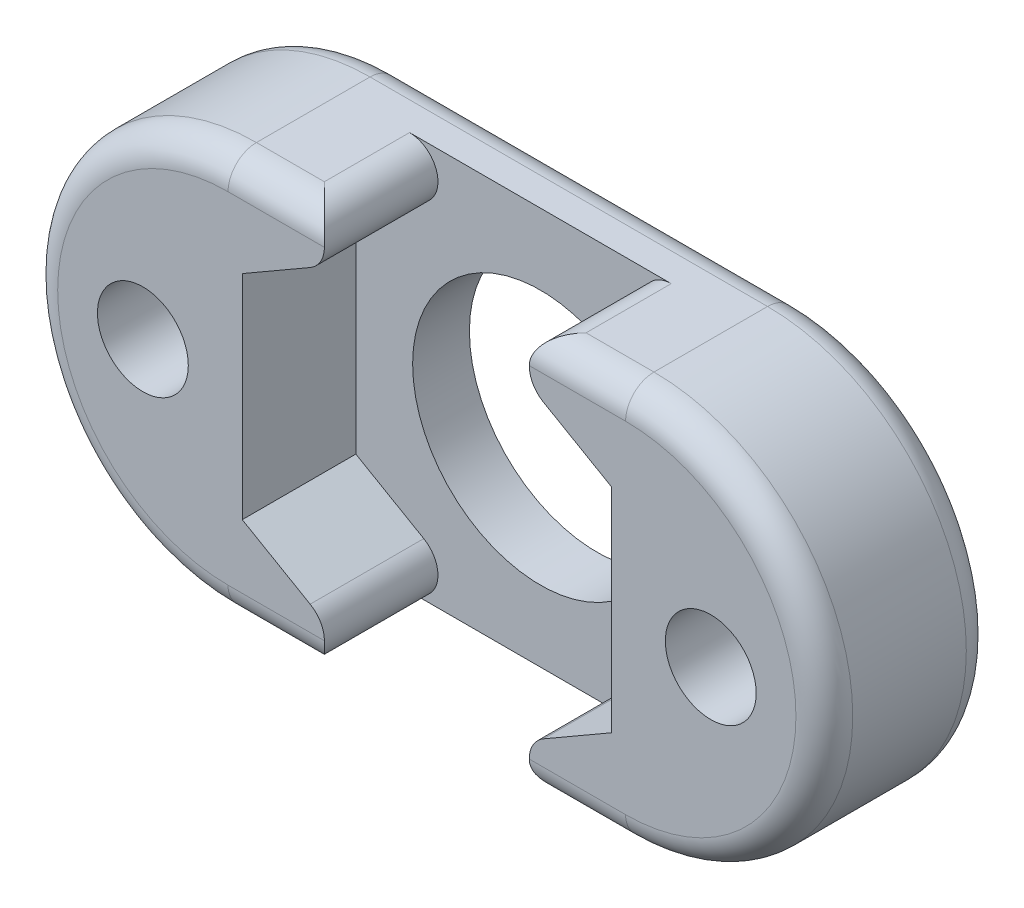
ISO-10303-21;
HEADER;
FILE_DESCRIPTION(('STEP AP214'),'2;1');
FILE_NAME('part.step','',(''),(''),'','','');
FILE_SCHEMA(('AUTOMOTIVE_DESIGN { 1 0 10303 214 1 1 1 1 }'));
ENDSEC;
DATA;
#1=APPLICATION_CONTEXT('core data for automotive mechanical design processes');
#2=APPLICATION_PROTOCOL_DEFINITION('international standard','automotive_design',2000,#1);
#3=PRODUCT_CONTEXT('',#1,'mechanical');
#4=PRODUCT('Part','Part','',(#3));
#5=PRODUCT_RELATED_PRODUCT_CATEGORY('part','',(#4));
#6=PRODUCT_DEFINITION_FORMATION('','',#4);
#7=PRODUCT_DEFINITION_CONTEXT('part definition',#1,'design');
#8=PRODUCT_DEFINITION('design','',#6,#7);
#9=PRODUCT_DEFINITION_SHAPE('','',#8);
#10=(LENGTH_UNIT() NAMED_UNIT(*) SI_UNIT(.MILLI.,.METRE.));
#11=(NAMED_UNIT(*) PLANE_ANGLE_UNIT() SI_UNIT($,.RADIAN.));
#12=(NAMED_UNIT(*) SI_UNIT($,.STERADIAN.) SOLID_ANGLE_UNIT());
#13=UNCERTAINTY_MEASURE_WITH_UNIT(LENGTH_MEASURE(1.E-05),#10,'distance_accuracy_value','');
#14=(GEOMETRIC_REPRESENTATION_CONTEXT(3) GLOBAL_UNCERTAINTY_ASSIGNED_CONTEXT((#13)) GLOBAL_UNIT_ASSIGNED_CONTEXT((#10,
#11,#12)) REPRESENTATION_CONTEXT('',''));
#15=CARTESIAN_POINT('',(0.,0.,0.));
#16=DIRECTION('',(0.,0.,1.));
#17=DIRECTION('',(1.,0.,0.));
#18=AXIS2_PLACEMENT_3D('',#15,#16,#17);
#19=CARTESIAN_POINT('',(-27.2541785109983,0.,6.));
#20=DIRECTION('',(0.,0.,1.));
#21=DIRECTION('',(1.,0.,0.));
#22=AXIS2_PLACEMENT_3D('',#19,#20,#21);
#23=PLANE('',#22);
#24=DIRECTION('',(-0.866025403784439,-0.5,0.));
#25=VECTOR('',#24,1.);
#26=CARTESIAN_POINT('',(-20.2541785109983,7.50555349946514,6.));
#27=LINE('',#26,#25);
#28=CARTESIAN_POINT('',(-24.3618736655851,5.13397459621556,6.));
#29=VERTEX_POINT('',#28);
#30=CARTESIAN_POINT('',(-26.7541785109983,3.75277674973257,6.));
#31=VERTEX_POINT('',#30);
#32=EDGE_CURVE('E223',#29,#31,#27,.T.);
#33=ORIENTED_EDGE('',*,*,#32,.F.);
#34=CARTESIAN_POINT('',(-24.8618736655851,6.,6.));
#35=DIRECTION('',(0.,0.,1.));
#36=DIRECTION('',(1.,0.,0.));
#37=AXIS2_PLACEMENT_3D('',#34,#35,#36);
#38=CIRCLE('',#37,1.);
#39=CARTESIAN_POINT('',(-23.8618736655851,6.,6.));
#40=VERTEX_POINT('',#39);
#41=EDGE_CURVE('E305',#29,#40,#38,.T.);
#42=ORIENTED_EDGE('',*,*,#41,.T.);
#43=DIRECTION('',(-1.,0.,0.));
#44=VECTOR('',#43,1.);
#45=CARTESIAN_POINT('',(-27.2541785109983,6.,6.));
#46=LINE('',#45,#44);
#47=CARTESIAN_POINT('',(-27.2541785109983,6.,6.));
#48=VERTEX_POINT('',#47);
#49=EDGE_CURVE('E300',#40,#48,#46,.T.);
#50=ORIENTED_EDGE('',*,*,#49,.T.);
#51=CARTESIAN_POINT('',(-27.2541785109983,0.,6.));
#52=DIRECTION('',(0.,0.,1.));
#53=DIRECTION('',(1.,0.,0.));
#54=AXIS2_PLACEMENT_3D('',#51,#52,#53);
#55=CIRCLE('',#54,6.);
#56=CARTESIAN_POINT('',(-27.2541785109983,-6.,6.));
#57=VERTEX_POINT('',#56);
#58=EDGE_CURVE('E296',#48,#57,#55,.T.);
#59=ORIENTED_EDGE('',*,*,#58,.T.);
#60=DIRECTION('',(1.,0.,0.));
#61=VECTOR('',#60,1.);
#62=CARTESIAN_POINT('',(-21.1298228580162,-6.,6.));
#63=LINE('',#62,#61);
#64=CARTESIAN_POINT('',(-23.861873665585,-6.,6.));
#65=VERTEX_POINT('',#64);
#66=EDGE_CURVE('E298',#57,#65,#63,.T.);
#67=ORIENTED_EDGE('',*,*,#66,.T.);
#68=CARTESIAN_POINT('',(-24.861873665585,-6.,6.));
#69=DIRECTION('',(0.,0.,1.));
#70=DIRECTION('',(1.,0.,0.));
#71=AXIS2_PLACEMENT_3D('',#68,#69,#70);
#72=CIRCLE('',#71,1.);
#73=CARTESIAN_POINT('',(-24.361873665585,-5.13397459621556,6.));
#74=VERTEX_POINT('',#73);
#75=EDGE_CURVE('E303',#65,#74,#72,.T.);
#76=ORIENTED_EDGE('',*,*,#75,.T.);
#77=DIRECTION('',(0.866025403784439,-0.5,0.));
#78=VECTOR('',#77,1.);
#79=CARTESIAN_POINT('',(-26.7541785109983,-3.75277674973256,6.));
#80=LINE('',#79,#78);
#81=CARTESIAN_POINT('',(-26.7541785109983,-3.75277674973256,6.));
#82=VERTEX_POINT('',#81);
#83=EDGE_CURVE('E191',#82,#74,#80,.T.);
#84=ORIENTED_EDGE('',*,*,#83,.F.);
#85=DIRECTION('',(0.,-1.,0.));
#86=VECTOR('',#85,1.);
#87=CARTESIAN_POINT('',(-26.7541785109983,3.75277674973257,6.));
#88=LINE('',#87,#86);
#89=EDGE_CURVE('E225',#31,#82,#88,.T.);
#90=ORIENTED_EDGE('',*,*,#89,.F.);
#91=EDGE_LOOP('',(#33,#42,#50,#59,#67,#76,#84,#90));
#92=FACE_BOUND('',#91,.T.);
#93=CARTESIAN_POINT('',(-30.2541785109983,0.,6.));
#94=DIRECTION('',(0.,0.,1.));
#95=DIRECTION('',(1.,0.,0.));
#96=AXIS2_PLACEMENT_3D('',#93,#94,#95);
#97=CIRCLE('',#96,1.60000000000001);
#98=CARTESIAN_POINT('',(-28.6541785109983,0.,6.));
#99=VERTEX_POINT('',#98);
#100=EDGE_CURVE('E244',#99,#99,#97,.T.);
#101=ORIENTED_EDGE('',*,*,#100,.F.);
#102=EDGE_LOOP('',(#101));
#103=FACE_BOUND('',#102,.T.);
#104=ADVANCED_FACE('F33',(#92,#103),#23,.T.);
#105=CARTESIAN_POINT('',(-20.2541785109983,0.,0.));
#106=DIRECTION('',(0.,0.,1.));
#107=DIRECTION('',(1.,0.,0.));
#108=AXIS2_PLACEMENT_3D('',#105,#106,#107);
#109=CYLINDRICAL_SURFACE('',#108,4.5);
#110=CARTESIAN_POINT('',(-20.2541785109983,0.,0.));
#111=DIRECTION('',(0.,0.,1.));
#112=DIRECTION('',(1.,0.,0.));
#113=AXIS2_PLACEMENT_3D('',#110,#111,#112);
#114=CIRCLE('',#113,4.5);
#115=CARTESIAN_POINT('',(-15.7541785109983,0.,0.));
#116=VERTEX_POINT('',#115);
#117=EDGE_CURVE('E250',#116,#116,#114,.T.);
#118=ORIENTED_EDGE('',*,*,#117,.F.);
#119=EDGE_LOOP('',(#118));
#120=FACE_BOUND('',#119,.T.);
#121=CARTESIAN_POINT('',(-20.2541785109983,0.,2.));
#122=DIRECTION('',(0.,0.,1.));
#123=DIRECTION('',(1.,0.,0.));
#124=AXIS2_PLACEMENT_3D('',#121,#122,#123);
#125=CIRCLE('',#124,4.5);
#126=CARTESIAN_POINT('',(-15.7541785109983,0.,2.));
#127=VERTEX_POINT('',#126);
#128=EDGE_CURVE('E231',#127,#127,#125,.F.);
#129=ORIENTED_EDGE('',*,*,#128,.F.);
#130=EDGE_LOOP('',(#129));
#131=FACE_BOUND('',#130,.T.);
#132=ADVANCED_FACE('F486',(#120,#131),#109,.F.);
#133=CARTESIAN_POINT('',(-27.2541785109983,0.,6.));
#134=DIRECTION('',(0.,0.,-1.));
#135=DIRECTION('',(-1.,0.,0.));
#136=AXIS2_PLACEMENT_3D('',#133,#134,#135);
#137=CYLINDRICAL_SURFACE('',#136,7.);
#138=DIRECTION('',(0.,0.,-1.));
#139=VECTOR('',#138,1.);
#140=CARTESIAN_POINT('',(-27.2541785109983,-7.,6.));
#141=LINE('',#140,#139);
#142=CARTESIAN_POINT('',(-27.2541785109983,-7.,5.));
#143=VERTEX_POINT('',#142);
#144=CARTESIAN_POINT('',(-27.2541785109983,-7.,1.));
#145=VERTEX_POINT('',#144);
#146=EDGE_CURVE('E264',#143,#145,#141,.T.);
#147=ORIENTED_EDGE('',*,*,#146,.F.);
#148=CARTESIAN_POINT('',(-27.2541785109983,0.,5.));
#149=DIRECTION('',(0.,0.,1.));
#150=DIRECTION('',(1.,0.,0.));
#151=AXIS2_PLACEMENT_3D('',#148,#149,#150);
#152=CIRCLE('',#151,7.);
#153=CARTESIAN_POINT('',(-27.2541785109983,7.,5.));
#154=VERTEX_POINT('',#153);
#155=EDGE_CURVE('E336',#143,#154,#152,.F.);
#156=ORIENTED_EDGE('',*,*,#155,.T.);
#157=DIRECTION('',(0.,0.,-1.));
#158=VECTOR('',#157,1.);
#159=CARTESIAN_POINT('',(-27.2541785109983,7.,6.));
#160=LINE('',#159,#158);
#161=CARTESIAN_POINT('',(-27.2541785109983,7.,1.));
#162=VERTEX_POINT('',#161);
#163=EDGE_CURVE('E255',#154,#162,#160,.T.);
#164=ORIENTED_EDGE('',*,*,#163,.T.);
#165=CARTESIAN_POINT('',(-27.2541785109983,0.,1.));
#166=DIRECTION('',(0.,0.,1.));
#167=DIRECTION('',(1.,0.,0.));
#168=AXIS2_PLACEMENT_3D('',#165,#166,#167);
#169=CIRCLE('',#168,7.);
#170=EDGE_CURVE('E334',#162,#145,#169,.T.);
#171=ORIENTED_EDGE('',*,*,#170,.T.);
#172=EDGE_LOOP('',(#147,#156,#164,#171));
#173=FACE_BOUND('',#172,.T.);
#174=ADVANCED_FACE('F400',(#173),#137,.T.);
#175=CARTESIAN_POINT('',(-27.2541785109983,-7.,6.));
#176=DIRECTION('',(0.,1.,0.));
#177=DIRECTION('',(0.,0.,1.));
#178=AXIS2_PLACEMENT_3D('',#175,#176,#177);
#179=PLANE('',#178);
#180=ORIENTED_EDGE('',*,*,#146,.T.);
#181=DIRECTION('',(1.,0.,0.));
#182=VECTOR('',#181,1.);
#183=CARTESIAN_POINT('',(-27.2541785109983,-7.,1.));
#184=LINE('',#183,#182);
#185=CARTESIAN_POINT('',(-13.2541785109983,-7.,1.));
#186=VERTEX_POINT('',#185);
#187=EDGE_CURVE('E316',#145,#186,#184,.T.);
#188=ORIENTED_EDGE('',*,*,#187,.T.);
#189=DIRECTION('',(0.,0.,-1.));
#190=VECTOR('',#189,1.);
#191=CARTESIAN_POINT('',(-13.2541785109983,-7.,6.));
#192=LINE('',#191,#190);
#193=CARTESIAN_POINT('',(-13.2541785109983,-7.,5.));
#194=VERTEX_POINT('',#193);
#195=EDGE_CURVE('E261',#194,#186,#192,.T.);
#196=ORIENTED_EDGE('',*,*,#195,.F.);
#197=DIRECTION('',(1.,0.,0.));
#198=VECTOR('',#197,1.);
#199=CARTESIAN_POINT('',(-19.3785341639805,-7.,5.));
#200=LINE('',#199,#198);
#201=CARTESIAN_POINT('',(-15.6464833564116,-7.,5.));
#202=VERTEX_POINT('',#201);
#203=EDGE_CURVE('E307',#194,#202,#200,.F.);
#204=ORIENTED_EDGE('',*,*,#203,.T.);
#205=DIRECTION('',(0.,0.,-1.));
#206=VECTOR('',#205,1.);
#207=CARTESIAN_POINT('',(-15.6464833564116,-7.,6.));
#208=LINE('',#207,#206);
#209=CARTESIAN_POINT('',(-15.6464833564116,-7.,2.));
#210=VERTEX_POINT('',#209);
#211=EDGE_CURVE('E309',#202,#210,#208,.T.);
#212=ORIENTED_EDGE('',*,*,#211,.T.);
#213=DIRECTION('',(1.,0.,0.));
#214=VECTOR('',#213,1.);
#215=CARTESIAN_POINT('',(-27.2541785109983,-7.,2.));
#216=LINE('',#215,#214);
#217=CARTESIAN_POINT('',(-24.861873665585,-7.,2.));
#218=VERTEX_POINT('',#217);
#219=EDGE_CURVE('E238',#218,#210,#216,.T.);
#220=ORIENTED_EDGE('',*,*,#219,.F.);
#221=DIRECTION('',(0.,0.,1.));
#222=VECTOR('',#221,1.);
#223=CARTESIAN_POINT('',(-24.861873665585,-7.,6.));
#224=LINE('',#223,#222);
#225=CARTESIAN_POINT('',(-24.861873665585,-7.,5.));
#226=VERTEX_POINT('',#225);
#227=EDGE_CURVE('E312',#218,#226,#224,.T.);
#228=ORIENTED_EDGE('',*,*,#227,.T.);
#229=DIRECTION('',(1.,0.,0.));
#230=VECTOR('',#229,1.);
#231=CARTESIAN_POINT('',(-27.2541785109983,-7.,5.));
#232=LINE('',#231,#230);
#233=EDGE_CURVE('E314',#226,#143,#232,.F.);
#234=ORIENTED_EDGE('',*,*,#233,.T.);
#235=EDGE_LOOP('',(#180,#188,#196,#204,#212,#220,#228,#234));
#236=FACE_BOUND('',#235,.T.);
#237=ADVANCED_FACE('F441',(#236),#179,.F.);
#238=CARTESIAN_POINT('',(-13.2541785109983,0.,6.));
#239=DIRECTION('',(0.,0.,-1.));
#240=DIRECTION('',(-1.,0.,0.));
#241=AXIS2_PLACEMENT_3D('',#238,#239,#240);
#242=CYLINDRICAL_SURFACE('',#241,7.);
#243=DIRECTION('',(0.,0.,-1.));
#244=VECTOR('',#243,1.);
#245=CARTESIAN_POINT('',(-13.2541785109983,7.,6.));
#246=LINE('',#245,#244);
#247=CARTESIAN_POINT('',(-13.2541785109983,7.,5.));
#248=VERTEX_POINT('',#247);
#249=CARTESIAN_POINT('',(-13.2541785109983,7.,1.));
#250=VERTEX_POINT('',#249);
#251=EDGE_CURVE('E258',#248,#250,#246,.T.);
#252=ORIENTED_EDGE('',*,*,#251,.F.);
#253=CARTESIAN_POINT('',(-13.2541785109983,0.,5.));
#254=DIRECTION('',(0.,0.,1.));
#255=DIRECTION('',(1.,0.,0.));
#256=AXIS2_PLACEMENT_3D('',#253,#254,#255);
#257=CIRCLE('',#256,7.);
#258=EDGE_CURVE('E294',#248,#194,#257,.F.);
#259=ORIENTED_EDGE('',*,*,#258,.T.);
#260=ORIENTED_EDGE('',*,*,#195,.T.);
#261=CARTESIAN_POINT('',(-13.2541785109983,0.,1.));
#262=DIRECTION('',(0.,0.,1.));
#263=DIRECTION('',(1.,0.,0.));
#264=AXIS2_PLACEMENT_3D('',#261,#262,#263);
#265=CIRCLE('',#264,7.);
#266=EDGE_CURVE('E292',#186,#250,#265,.T.);
#267=ORIENTED_EDGE('',*,*,#266,.T.);
#268=EDGE_LOOP('',(#252,#259,#260,#267));
#269=FACE_BOUND('',#268,.T.);
#270=ADVANCED_FACE('F473',(#269),#242,.T.);
#271=CARTESIAN_POINT('',(-27.2541785109983,7.,6.));
#272=DIRECTION('',(0.,-1.,0.));
#273=DIRECTION('',(0.,0.,-1.));
#274=AXIS2_PLACEMENT_3D('',#271,#272,#273);
#275=PLANE('',#274);
#276=ORIENTED_EDGE('',*,*,#251,.T.);
#277=DIRECTION('',(-1.,0.,0.));
#278=VECTOR('',#277,1.);
#279=CARTESIAN_POINT('',(-27.2541785109983,7.,1.));
#280=LINE('',#279,#278);
#281=EDGE_CURVE('E289',#250,#162,#280,.T.);
#282=ORIENTED_EDGE('',*,*,#281,.T.);
#283=ORIENTED_EDGE('',*,*,#163,.F.);
#284=DIRECTION('',(-1.,0.,0.));
#285=VECTOR('',#284,1.);
#286=CARTESIAN_POINT('',(-21.1298228580162,7.,5.));
#287=LINE('',#286,#285);
#288=CARTESIAN_POINT('',(-24.8618736655851,7.,5.));
#289=VERTEX_POINT('',#288);
#290=EDGE_CURVE('E283',#154,#289,#287,.F.);
#291=ORIENTED_EDGE('',*,*,#290,.T.);
#292=DIRECTION('',(0.,0.,-1.));
#293=VECTOR('',#292,1.);
#294=CARTESIAN_POINT('',(-24.8618736655851,7.,6.));
#295=LINE('',#294,#293);
#296=CARTESIAN_POINT('',(-24.8618736655851,7.,2.));
#297=VERTEX_POINT('',#296);
#298=EDGE_CURVE('E280',#289,#297,#295,.T.);
#299=ORIENTED_EDGE('',*,*,#298,.T.);
#300=DIRECTION('',(-1.,0.,0.));
#301=VECTOR('',#300,1.);
#302=CARTESIAN_POINT('',(-27.2541785109983,7.,2.));
#303=LINE('',#302,#301);
#304=CARTESIAN_POINT('',(-15.6464833564116,7.,2.));
#305=VERTEX_POINT('',#304);
#306=EDGE_CURVE('E236',#305,#297,#303,.T.);
#307=ORIENTED_EDGE('',*,*,#306,.F.);
#308=DIRECTION('',(0.,0.,1.));
#309=VECTOR('',#308,1.);
#310=CARTESIAN_POINT('',(-15.6464833564116,7.,6.));
#311=LINE('',#310,#309);
#312=CARTESIAN_POINT('',(-15.6464833564116,7.,5.));
#313=VERTEX_POINT('',#312);
#314=EDGE_CURVE('E285',#305,#313,#311,.T.);
#315=ORIENTED_EDGE('',*,*,#314,.T.);
#316=DIRECTION('',(-1.,0.,0.));
#317=VECTOR('',#316,1.);
#318=CARTESIAN_POINT('',(-13.2541785109983,7.,5.));
#319=LINE('',#318,#317);
#320=EDGE_CURVE('E287',#313,#248,#319,.F.);
#321=ORIENTED_EDGE('',*,*,#320,.T.);
#322=EDGE_LOOP('',(#276,#282,#283,#291,#299,#307,#315,#321));
#323=FACE_BOUND('',#322,.T.);
#324=ADVANCED_FACE('F397',(#323),#275,.F.);
#325=DIRECTION('',(-1.,0.,0.));
#326=VECTOR('',#325,1.);
#327=CARTESIAN_POINT('',(-19.3785341639805,6.,6.));
#328=LINE('',#327,#326);
#329=CARTESIAN_POINT('',(-13.2541785109983,6.,6.));
#330=VERTEX_POINT('',#329);
#331=CARTESIAN_POINT('',(-16.6464833564116,6.,6.));
#332=VERTEX_POINT('',#331);
#333=EDGE_CURVE('E275',#330,#332,#328,.T.);
#334=ORIENTED_EDGE('',*,*,#333,.T.);
#335=CARTESIAN_POINT('',(-15.6464833564116,6.,6.));
#336=DIRECTION('',(0.,0.,1.));
#337=DIRECTION('',(1.,0.,0.));
#338=AXIS2_PLACEMENT_3D('',#335,#336,#337);
#339=CIRCLE('',#338,1.);
#340=CARTESIAN_POINT('',(-16.1464833564116,5.13397459621556,6.));
#341=VERTEX_POINT('',#340);
#342=EDGE_CURVE('E278',#332,#341,#339,.T.);
#343=ORIENTED_EDGE('',*,*,#342,.T.);
#344=DIRECTION('',(-0.866025403784439,0.5,0.));
#345=VECTOR('',#344,1.);
#346=CARTESIAN_POINT('',(-13.7541785109983,3.75277674973257,6.));
#347=LINE('',#346,#345);
#348=CARTESIAN_POINT('',(-13.7541785109983,3.75277674973257,6.));
#349=VERTEX_POINT('',#348);
#350=EDGE_CURVE('E220',#349,#341,#347,.T.);
#351=ORIENTED_EDGE('',*,*,#350,.F.);
#352=DIRECTION('',(0.,1.,0.));
#353=VECTOR('',#352,1.);
#354=CARTESIAN_POINT('',(-13.7541785109983,-3.75277674973257,6.));
#355=LINE('',#354,#353);
#356=CARTESIAN_POINT('',(-13.7541785109983,-3.75277674973257,6.));
#357=VERTEX_POINT('',#356);
#358=EDGE_CURVE('E217',#357,#349,#355,.T.);
#359=ORIENTED_EDGE('',*,*,#358,.F.);
#360=DIRECTION('',(0.866025403784438,0.5,0.));
#361=VECTOR('',#360,1.);
#362=CARTESIAN_POINT('',(-20.2541785109983,-7.50555349946513,6.));
#363=LINE('',#362,#361);
#364=CARTESIAN_POINT('',(-16.1464833564116,-5.13397459621556,6.));
#365=VERTEX_POINT('',#364);
#366=EDGE_CURVE('E197',#365,#357,#363,.T.);
#367=ORIENTED_EDGE('',*,*,#366,.F.);
#368=CARTESIAN_POINT('',(-15.6464833564116,-6.,6.));
#369=DIRECTION('',(0.,0.,1.));
#370=DIRECTION('',(1.,0.,0.));
#371=AXIS2_PLACEMENT_3D('',#368,#369,#370);
#372=CIRCLE('',#371,1.);
#373=CARTESIAN_POINT('',(-16.6464833564116,-6.,6.));
#374=VERTEX_POINT('',#373);
#375=EDGE_CURVE('E271',#365,#374,#372,.T.);
#376=ORIENTED_EDGE('',*,*,#375,.T.);
#377=DIRECTION('',(1.,0.,0.));
#378=VECTOR('',#377,1.);
#379=CARTESIAN_POINT('',(-13.2541785109983,-6.,6.));
#380=LINE('',#379,#378);
#381=CARTESIAN_POINT('',(-13.2541785109983,-6.,6.));
#382=VERTEX_POINT('',#381);
#383=EDGE_CURVE('E267',#374,#382,#380,.T.);
#384=ORIENTED_EDGE('',*,*,#383,.T.);
#385=CARTESIAN_POINT('',(-13.2541785109983,0.,6.));
#386=DIRECTION('',(0.,0.,1.));
#387=DIRECTION('',(1.,0.,0.));
#388=AXIS2_PLACEMENT_3D('',#385,#386,#387);
#389=CIRCLE('',#388,6.);
#390=EDGE_CURVE('E273',#382,#330,#389,.T.);
#391=ORIENTED_EDGE('',*,*,#390,.T.);
#392=EDGE_LOOP('',(#334,#343,#351,#359,#367,#376,#384,#391));
#393=FACE_BOUND('',#392,.T.);
#394=CARTESIAN_POINT('',(-10.2541785109983,0.,6.));
#395=DIRECTION('',(0.,0.,1.));
#396=DIRECTION('',(1.,0.,0.));
#397=AXIS2_PLACEMENT_3D('',#394,#395,#396);
#398=CIRCLE('',#397,1.6);
#399=CARTESIAN_POINT('',(-8.65417851099832,0.,6.));
#400=VERTEX_POINT('',#399);
#401=EDGE_CURVE('E240',#400,#400,#398,.T.);
#402=ORIENTED_EDGE('',*,*,#401,.F.);
#403=EDGE_LOOP('',(#402));
#404=FACE_BOUND('',#403,.T.);
#405=ADVANCED_FACE('F450',(#393,#404),#23,.T.);
#406=CARTESIAN_POINT('',(-27.2541785109983,0.,0.));
#407=DIRECTION('',(0.,0.,1.));
#408=DIRECTION('',(1.,0.,0.));
#409=AXIS2_PLACEMENT_3D('',#406,#407,#408);
#410=PLANE('',#409);
#411=CARTESIAN_POINT('',(-27.2541785109983,0.,0.));
#412=DIRECTION('',(0.,0.,1.));
#413=DIRECTION('',(1.,0.,0.));
#414=AXIS2_PLACEMENT_3D('',#411,#412,#413);
#415=CIRCLE('',#414,6.);
#416=CARTESIAN_POINT('',(-27.2541785109983,-6.,0.));
#417=VERTEX_POINT('',#416);
#418=CARTESIAN_POINT('',(-27.2541785109983,6.,0.));
#419=VERTEX_POINT('',#418);
#420=EDGE_CURVE('E318',#417,#419,#415,.F.);
#421=ORIENTED_EDGE('',*,*,#420,.T.);
#422=DIRECTION('',(-1.,0.,0.));
#423=VECTOR('',#422,1.);
#424=CARTESIAN_POINT('',(-27.2541785109983,6.,0.));
#425=LINE('',#424,#423);
#426=CARTESIAN_POINT('',(-13.2541785109983,6.,0.));
#427=VERTEX_POINT('',#426);
#428=EDGE_CURVE('E324',#419,#427,#425,.F.);
#429=ORIENTED_EDGE('',*,*,#428,.T.);
#430=CARTESIAN_POINT('',(-13.2541785109983,0.,0.));
#431=DIRECTION('',(0.,0.,1.));
#432=DIRECTION('',(1.,0.,0.));
#433=AXIS2_PLACEMENT_3D('',#430,#431,#432);
#434=CIRCLE('',#433,6.);
#435=CARTESIAN_POINT('',(-13.2541785109983,-6.,0.));
#436=VERTEX_POINT('',#435);
#437=EDGE_CURVE('E322',#427,#436,#434,.F.);
#438=ORIENTED_EDGE('',*,*,#437,.T.);
#439=DIRECTION('',(1.,0.,0.));
#440=VECTOR('',#439,1.);
#441=CARTESIAN_POINT('',(-27.2541785109983,-6.,0.));
#442=LINE('',#441,#440);
#443=EDGE_CURVE('E320',#436,#417,#442,.F.);
#444=ORIENTED_EDGE('',*,*,#443,.T.);
#445=EDGE_LOOP('',(#421,#429,#438,#444));
#446=FACE_BOUND('',#445,.T.);
#447=CARTESIAN_POINT('',(-10.2541785109983,0.,0.));
#448=DIRECTION('',(0.,0.,1.));
#449=DIRECTION('',(1.,0.,0.));
#450=AXIS2_PLACEMENT_3D('',#447,#448,#449);
#451=CIRCLE('',#450,1.6);
#452=CARTESIAN_POINT('',(-8.65417851099832,0.,0.));
#453=VERTEX_POINT('',#452);
#454=EDGE_CURVE('E241',#453,#453,#451,.T.);
#455=ORIENTED_EDGE('',*,*,#454,.T.);
#456=EDGE_LOOP('',(#455));
#457=FACE_BOUND('',#456,.T.);
#458=CARTESIAN_POINT('',(-30.2541785109983,0.,0.));
#459=DIRECTION('',(0.,0.,1.));
#460=DIRECTION('',(1.,0.,0.));
#461=AXIS2_PLACEMENT_3D('',#458,#459,#460);
#462=CIRCLE('',#461,1.60000000000001);
#463=CARTESIAN_POINT('',(-28.6541785109983,0.,0.));
#464=VERTEX_POINT('',#463);
#465=EDGE_CURVE('E247',#464,#464,#462,.T.);
#466=ORIENTED_EDGE('',*,*,#465,.T.);
#467=EDGE_LOOP('',(#466));
#468=FACE_BOUND('',#467,.T.);
#469=ORIENTED_EDGE('',*,*,#117,.T.);
#470=EDGE_LOOP('',(#469));
#471=FACE_BOUND('',#470,.T.);
#472=ADVANCED_FACE('F385',(#446,#457,#468,#471),#410,.F.);
#473=CARTESIAN_POINT('',(-30.2541785109983,0.,0.));
#474=DIRECTION('',(0.,0.,1.));
#475=DIRECTION('',(1.,0.,0.));
#476=AXIS2_PLACEMENT_3D('',#473,#474,#475);
#477=CYLINDRICAL_SURFACE('',#476,1.60000000000001);
#478=ORIENTED_EDGE('',*,*,#465,.F.);
#479=EDGE_LOOP('',(#478));
#480=FACE_BOUND('',#479,.T.);
#481=ORIENTED_EDGE('',*,*,#100,.T.);
#482=EDGE_LOOP('',(#481));
#483=FACE_BOUND('',#482,.T.);
#484=ADVANCED_FACE('F499',(#480,#483),#477,.F.);
#485=CARTESIAN_POINT('',(-10.2541785109983,0.,0.));
#486=DIRECTION('',(0.,0.,1.));
#487=DIRECTION('',(1.,0.,0.));
#488=AXIS2_PLACEMENT_3D('',#485,#486,#487);
#489=CYLINDRICAL_SURFACE('',#488,1.6);
#490=ORIENTED_EDGE('',*,*,#454,.F.);
#491=EDGE_LOOP('',(#490));
#492=FACE_BOUND('',#491,.T.);
#493=ORIENTED_EDGE('',*,*,#401,.T.);
#494=EDGE_LOOP('',(#493));
#495=FACE_BOUND('',#494,.T.);
#496=ADVANCED_FACE('F660',(#492,#495),#489,.F.);
#497=CARTESIAN_POINT('',(-20.2541785109983,-7.50555349946513,2.));
#498=DIRECTION('',(0.5,-0.866025403784439,0.));
#499=DIRECTION('',(0.866025403784438,0.5,0.));
#500=AXIS2_PLACEMENT_3D('',#497,#498,#499);
#501=PLANE('',#500);
#502=DIRECTION('',(0.866025403784438,0.5,0.));
#503=VECTOR('',#502,1.);
#504=CARTESIAN_POINT('',(-20.2541785109983,-7.50555349946513,2.));
#505=LINE('',#504,#503);
#506=CARTESIAN_POINT('',(-16.1464833564116,-5.13397459621556,2.));
#507=VERTEX_POINT('',#506);
#508=CARTESIAN_POINT('',(-13.7541785109983,-3.75277674973257,2.));
#509=VERTEX_POINT('',#508);
#510=EDGE_CURVE('E183',#507,#509,#505,.T.);
#511=ORIENTED_EDGE('',*,*,#510,.F.);
#512=DIRECTION('',(0.,0.,-1.));
#513=VECTOR('',#512,1.);
#514=CARTESIAN_POINT('',(-16.1464833564116,-5.13397459621556,2.));
#515=LINE('',#514,#513);
#516=EDGE_CURVE('E331',#507,#365,#515,.F.);
#517=ORIENTED_EDGE('',*,*,#516,.T.);
#518=ORIENTED_EDGE('',*,*,#366,.T.);
#519=DIRECTION('',(0.,0.,1.));
#520=VECTOR('',#519,1.);
#521=CARTESIAN_POINT('',(-13.7541785109983,-3.75277674973257,2.));
#522=LINE('',#521,#520);
#523=EDGE_CURVE('E194',#509,#357,#522,.T.);
#524=ORIENTED_EDGE('',*,*,#523,.F.);
#525=EDGE_LOOP('',(#511,#517,#518,#524));
#526=FACE_BOUND('',#525,.T.);
#527=ADVANCED_FACE('F195',(#526),#501,.F.);
#528=CARTESIAN_POINT('',(-26.7541785109983,-3.75277674973256,2.));
#529=DIRECTION('',(-0.5,-0.866025403784439,0.));
#530=DIRECTION('',(0.866025403784439,-0.5,0.));
#531=AXIS2_PLACEMENT_3D('',#528,#529,#530);
#532=PLANE('',#531);
#533=ORIENTED_EDGE('',*,*,#83,.T.);
#534=DIRECTION('',(0.,0.,1.));
#535=VECTOR('',#534,1.);
#536=CARTESIAN_POINT('',(-24.361873665585,-5.13397459621556,2.));
#537=LINE('',#536,#535);
#538=CARTESIAN_POINT('',(-24.361873665585,-5.13397459621556,2.));
#539=VERTEX_POINT('',#538);
#540=EDGE_CURVE('E50',#74,#539,#537,.F.);
#541=ORIENTED_EDGE('',*,*,#540,.T.);
#542=DIRECTION('',(0.866025403784439,-0.5,0.));
#543=VECTOR('',#542,1.);
#544=CARTESIAN_POINT('',(-26.7541785109983,-3.75277674973256,2.));
#545=LINE('',#544,#543);
#546=CARTESIAN_POINT('',(-26.7541785109983,-3.75277674973256,2.));
#547=VERTEX_POINT('',#546);
#548=EDGE_CURVE('E202',#547,#539,#545,.T.);
#549=ORIENTED_EDGE('',*,*,#548,.F.);
#550=DIRECTION('',(0.,0.,1.));
#551=VECTOR('',#550,1.);
#552=CARTESIAN_POINT('',(-26.7541785109983,-3.75277674973256,2.));
#553=LINE('',#552,#551);
#554=EDGE_CURVE('E229',#547,#82,#553,.T.);
#555=ORIENTED_EDGE('',*,*,#554,.T.);
#556=EDGE_LOOP('',(#533,#541,#549,#555));
#557=FACE_BOUND('',#556,.T.);
#558=ADVANCED_FACE('F427',(#557),#532,.F.);
#559=CARTESIAN_POINT('',(-20.2541785109983,7.50555349946514,2.));
#560=DIRECTION('',(-0.5,0.866025403784439,0.));
#561=DIRECTION('',(-0.866025403784439,-0.5,0.));
#562=AXIS2_PLACEMENT_3D('',#559,#560,#561);
#563=PLANE('',#562);
#564=DIRECTION('',(-0.866025403784439,-0.5,0.));
#565=VECTOR('',#564,1.);
#566=CARTESIAN_POINT('',(-20.2541785109983,7.50555349946514,2.));
#567=LINE('',#566,#565);
#568=CARTESIAN_POINT('',(-24.3618736655851,5.13397459621556,2.));
#569=VERTEX_POINT('',#568);
#570=CARTESIAN_POINT('',(-26.7541785109983,3.75277674973257,2.));
#571=VERTEX_POINT('',#570);
#572=EDGE_CURVE('E208',#569,#571,#567,.T.);
#573=ORIENTED_EDGE('',*,*,#572,.F.);
#574=DIRECTION('',(0.,0.,-1.));
#575=VECTOR('',#574,1.);
#576=CARTESIAN_POINT('',(-24.3618736655851,5.13397459621556,2.));
#577=LINE('',#576,#575);
#578=EDGE_CURVE('E329',#569,#29,#577,.F.);
#579=ORIENTED_EDGE('',*,*,#578,.T.);
#580=ORIENTED_EDGE('',*,*,#32,.T.);
#581=DIRECTION('',(0.,0.,1.));
#582=VECTOR('',#581,1.);
#583=CARTESIAN_POINT('',(-26.7541785109983,3.75277674973257,2.));
#584=LINE('',#583,#582);
#585=EDGE_CURVE('E232',#571,#31,#584,.T.);
#586=ORIENTED_EDGE('',*,*,#585,.F.);
#587=EDGE_LOOP('',(#573,#579,#580,#586));
#588=FACE_BOUND('',#587,.T.);
#589=ADVANCED_FACE('F420',(#588),#563,.F.);
#590=CARTESIAN_POINT('',(-13.7541785109983,3.75277674973257,2.));
#591=DIRECTION('',(0.5,0.866025403784439,0.));
#592=DIRECTION('',(-0.866025403784439,0.5,0.));
#593=AXIS2_PLACEMENT_3D('',#590,#591,#592);
#594=PLANE('',#593);
#595=ORIENTED_EDGE('',*,*,#350,.T.);
#596=DIRECTION('',(0.,0.,1.));
#597=VECTOR('',#596,1.);
#598=CARTESIAN_POINT('',(-16.1464833564116,5.13397459621556,2.));
#599=LINE('',#598,#597);
#600=CARTESIAN_POINT('',(-16.1464833564116,5.13397459621556,2.));
#601=VERTEX_POINT('',#600);
#602=EDGE_CURVE('E327',#341,#601,#599,.F.);
#603=ORIENTED_EDGE('',*,*,#602,.T.);
#604=DIRECTION('',(-0.866025403784439,0.5,0.));
#605=VECTOR('',#604,1.);
#606=CARTESIAN_POINT('',(-13.7541785109983,3.75277674973257,2.));
#607=LINE('',#606,#605);
#608=CARTESIAN_POINT('',(-13.7541785109983,3.75277674973257,2.));
#609=VERTEX_POINT('',#608);
#610=EDGE_CURVE('E206',#609,#601,#607,.T.);
#611=ORIENTED_EDGE('',*,*,#610,.F.);
#612=DIRECTION('',(0.,0.,1.));
#613=VECTOR('',#612,1.);
#614=CARTESIAN_POINT('',(-13.7541785109983,3.75277674973257,2.));
#615=LINE('',#614,#613);
#616=EDGE_CURVE('E201',#609,#349,#615,.T.);
#617=ORIENTED_EDGE('',*,*,#616,.T.);
#618=EDGE_LOOP('',(#595,#603,#611,#617));
#619=FACE_BOUND('',#618,.T.);
#620=ADVANCED_FACE('F456',(#619),#594,.F.);
#621=CARTESIAN_POINT('',(0.,0.,2.));
#622=DIRECTION('',(0.,0.,1.));
#623=DIRECTION('',(1.,0.,0.));
#624=AXIS2_PLACEMENT_3D('',#621,#622,#623);
#625=PLANE('',#624);
#626=ORIENTED_EDGE('',*,*,#128,.T.);
#627=EDGE_LOOP('',(#626));
#628=FACE_BOUND('',#627,.T.);
#629=ORIENTED_EDGE('',*,*,#219,.T.);
#630=CARTESIAN_POINT('',(-15.6464833564116,-6.,2.));
#631=DIRECTION('',(0.,0.,1.));
#632=DIRECTION('',(1.,0.,0.));
#633=AXIS2_PLACEMENT_3D('',#630,#631,#632);
#634=CIRCLE('',#633,1.);
#635=EDGE_CURVE('E42',#210,#507,#634,.F.);
#636=ORIENTED_EDGE('',*,*,#635,.T.);
#637=ORIENTED_EDGE('',*,*,#510,.T.);
#638=DIRECTION('',(0.,1.,0.));
#639=VECTOR('',#638,1.);
#640=CARTESIAN_POINT('',(-13.7541785109983,-3.75277674973257,2.));
#641=LINE('',#640,#639);
#642=EDGE_CURVE('E188',#509,#609,#641,.T.);
#643=ORIENTED_EDGE('',*,*,#642,.T.);
#644=ORIENTED_EDGE('',*,*,#610,.T.);
#645=CARTESIAN_POINT('',(-15.6464833564116,6.,2.));
#646=DIRECTION('',(0.,0.,1.));
#647=DIRECTION('',(1.,0.,0.));
#648=AXIS2_PLACEMENT_3D('',#645,#646,#647);
#649=CIRCLE('',#648,1.);
#650=EDGE_CURVE('E338',#601,#305,#649,.F.);
#651=ORIENTED_EDGE('',*,*,#650,.T.);
#652=ORIENTED_EDGE('',*,*,#306,.T.);
#653=CARTESIAN_POINT('',(-24.8618736655851,6.,2.));
#654=DIRECTION('',(0.,0.,1.));
#655=DIRECTION('',(1.,0.,0.));
#656=AXIS2_PLACEMENT_3D('',#653,#654,#655);
#657=CIRCLE('',#656,1.);
#658=EDGE_CURVE('E341',#297,#569,#657,.F.);
#659=ORIENTED_EDGE('',*,*,#658,.T.);
#660=ORIENTED_EDGE('',*,*,#572,.T.);
#661=DIRECTION('',(0.,-1.,0.));
#662=VECTOR('',#661,1.);
#663=CARTESIAN_POINT('',(-26.7541785109983,3.75277674973257,2.));
#664=LINE('',#663,#662);
#665=EDGE_CURVE('E212',#571,#547,#664,.T.);
#666=ORIENTED_EDGE('',*,*,#665,.T.);
#667=ORIENTED_EDGE('',*,*,#548,.T.);
#668=CARTESIAN_POINT('',(-24.861873665585,-6.,2.));
#669=DIRECTION('',(0.,0.,1.));
#670=DIRECTION('',(1.,0.,0.));
#671=AXIS2_PLACEMENT_3D('',#668,#669,#670);
#672=CIRCLE('',#671,1.);
#673=EDGE_CURVE('E11',#539,#218,#672,.F.);
#674=ORIENTED_EDGE('',*,*,#673,.T.);
#675=EDGE_LOOP('',(#629,#636,#637,#643,#644,#651,#652,#659,#660,#666,#667,#674));
#676=FACE_BOUND('',#675,.T.);
#677=ADVANCED_FACE('F185',(#628,#676),#625,.T.);
#678=CARTESIAN_POINT('',(-26.7541785109983,3.75277674973257,2.));
#679=DIRECTION('',(-1.,0.,0.));
#680=DIRECTION('',(0.,0.,1.));
#681=AXIS2_PLACEMENT_3D('',#678,#679,#680);
#682=PLANE('',#681);
#683=ORIENTED_EDGE('',*,*,#89,.T.);
#684=ORIENTED_EDGE('',*,*,#554,.F.);
#685=ORIENTED_EDGE('',*,*,#665,.F.);
#686=ORIENTED_EDGE('',*,*,#585,.T.);
#687=EDGE_LOOP('',(#683,#684,#685,#686));
#688=FACE_BOUND('',#687,.T.);
#689=ADVANCED_FACE('F425',(#688),#682,.F.);
#690=CARTESIAN_POINT('',(-13.7541785109983,-3.75277674973257,2.));
#691=DIRECTION('',(1.,0.,0.));
#692=DIRECTION('',(0.,1.,0.));
#693=AXIS2_PLACEMENT_3D('',#690,#691,#692);
#694=PLANE('',#693);
#695=ORIENTED_EDGE('',*,*,#358,.T.);
#696=ORIENTED_EDGE('',*,*,#616,.F.);
#697=ORIENTED_EDGE('',*,*,#642,.F.);
#698=ORIENTED_EDGE('',*,*,#523,.T.);
#699=EDGE_LOOP('',(#695,#696,#697,#698));
#700=FACE_BOUND('',#699,.T.);
#701=ADVANCED_FACE('F204',(#700),#694,.F.);
#702=CARTESIAN_POINT('',(-15.6464833564116,-6.,6.));
#703=DIRECTION('',(0.,0.,-1.));
#704=DIRECTION('',(-1.,0.,0.));
#705=AXIS2_PLACEMENT_3D('',#702,#703,#704);
#706=CYLINDRICAL_SURFACE('',#705,1.);
#707=ORIENTED_EDGE('',*,*,#635,.F.);
#708=ORIENTED_EDGE('',*,*,#211,.F.);
#709=CARTESIAN_POINT('',(-15.6464833564116,-6.,5.));
#710=DIRECTION('',(-0.707106781186547,0.,-0.707106781186547));
#711=DIRECTION('',(-0.707106781186547,0.,0.707106781186547));
#712=AXIS2_PLACEMENT_3D('',#709,#710,#711);
#713=ELLIPSE('',#712,1.41421356237309,1.);
#714=EDGE_CURVE('E218',#374,#202,#713,.F.);
#715=ORIENTED_EDGE('',*,*,#714,.F.);
#716=ORIENTED_EDGE('',*,*,#375,.F.);
#717=ORIENTED_EDGE('',*,*,#516,.F.);
#718=EDGE_LOOP('',(#707,#708,#715,#716,#717));
#719=FACE_BOUND('',#718,.T.);
#720=ADVANCED_FACE('F447',(#719),#706,.T.);
#721=CARTESIAN_POINT('',(-27.2541785109983,-6.,5.));
#722=DIRECTION('',(-1.,0.,0.));
#723=DIRECTION('',(0.,0.,1.));
#724=AXIS2_PLACEMENT_3D('',#721,#722,#723);
#725=CYLINDRICAL_SURFACE('',#724,1.);
#726=ORIENTED_EDGE('',*,*,#714,.T.);
#727=ORIENTED_EDGE('',*,*,#203,.F.);
#728=CARTESIAN_POINT('',(-13.2541785109983,-6.,5.));
#729=DIRECTION('',(1.,0.,0.));
#730=DIRECTION('',(0.,0.,-1.));
#731=AXIS2_PLACEMENT_3D('',#728,#729,#730);
#732=CIRCLE('',#731,1.);
#733=EDGE_CURVE('E350',#382,#194,#732,.T.);
#734=ORIENTED_EDGE('',*,*,#733,.F.);
#735=ORIENTED_EDGE('',*,*,#383,.F.);
#736=EDGE_LOOP('',(#726,#727,#734,#735));
#737=FACE_BOUND('',#736,.T.);
#738=ADVANCED_FACE('F475',(#737),#725,.T.);
#739=CARTESIAN_POINT('',(-13.2541785109983,0.,5.));
#740=DIRECTION('',(0.,0.,1.));
#741=DIRECTION('',(1.,0.,0.));
#742=AXIS2_PLACEMENT_3D('',#739,#740,#741);
#743=TOROIDAL_SURFACE('',#742,6.,1.);
#744=ORIENTED_EDGE('',*,*,#733,.T.);
#745=ORIENTED_EDGE('',*,*,#258,.F.);
#746=CARTESIAN_POINT('',(-13.2541785109983,6.,5.));
#747=DIRECTION('',(-1.,0.,0.));
#748=DIRECTION('',(0.,0.,1.));
#749=AXIS2_PLACEMENT_3D('',#746,#747,#748);
#750=CIRCLE('',#749,1.);
#751=EDGE_CURVE('E346',#330,#248,#750,.T.);
#752=ORIENTED_EDGE('',*,*,#751,.F.);
#753=ORIENTED_EDGE('',*,*,#390,.F.);
#754=EDGE_LOOP('',(#744,#745,#752,#753));
#755=FACE_BOUND('',#754,.T.);
#756=ADVANCED_FACE('F470',(#755),#743,.T.);
#757=CARTESIAN_POINT('',(-15.6464833564116,6.,6.));
#758=DIRECTION('',(0.,0.,1.));
#759=DIRECTION('',(1.,0.,0.));
#760=AXIS2_PLACEMENT_3D('',#757,#758,#759);
#761=CYLINDRICAL_SURFACE('',#760,1.);
#762=ORIENTED_EDGE('',*,*,#602,.F.);
#763=ORIENTED_EDGE('',*,*,#342,.F.);
#764=CARTESIAN_POINT('',(-15.6464833564116,6.,5.));
#765=DIRECTION('',(0.707106781186547,0.,0.707106781186547));
#766=DIRECTION('',(-0.707106781186547,0.,0.707106781186547));
#767=AXIS2_PLACEMENT_3D('',#764,#765,#766);
#768=ELLIPSE('',#767,1.41421356237309,1.);
#769=EDGE_CURVE('E344',#313,#332,#768,.T.);
#770=ORIENTED_EDGE('',*,*,#769,.F.);
#771=ORIENTED_EDGE('',*,*,#314,.F.);
#772=ORIENTED_EDGE('',*,*,#650,.F.);
#773=EDGE_LOOP('',(#762,#763,#770,#771,#772));
#774=FACE_BOUND('',#773,.T.);
#775=ADVANCED_FACE('F459',(#774),#761,.T.);
#776=CARTESIAN_POINT('',(-27.2541785109983,6.,5.));
#777=DIRECTION('',(1.,0.,0.));
#778=DIRECTION('',(0.,0.,-1.));
#779=AXIS2_PLACEMENT_3D('',#776,#777,#778);
#780=CYLINDRICAL_SURFACE('',#779,1.);
#781=ORIENTED_EDGE('',*,*,#751,.T.);
#782=ORIENTED_EDGE('',*,*,#320,.F.);
#783=ORIENTED_EDGE('',*,*,#769,.T.);
#784=ORIENTED_EDGE('',*,*,#333,.F.);
#785=EDGE_LOOP('',(#781,#782,#783,#784));
#786=FACE_BOUND('',#785,.T.);
#787=ADVANCED_FACE('F464',(#786),#780,.T.);
#788=CARTESIAN_POINT('',(-24.861873665585,-6.,6.));
#789=DIRECTION('',(0.,0.,1.));
#790=DIRECTION('',(1.,0.,0.));
#791=AXIS2_PLACEMENT_3D('',#788,#789,#790);
#792=CYLINDRICAL_SURFACE('',#791,1.);
#793=ORIENTED_EDGE('',*,*,#540,.F.);
#794=ORIENTED_EDGE('',*,*,#75,.F.);
#795=CARTESIAN_POINT('',(-24.861873665585,-6.,5.));
#796=DIRECTION('',(-0.707106781186547,0.,0.707106781186547));
#797=DIRECTION('',(0.707106781186547,0.,0.707106781186547));
#798=AXIS2_PLACEMENT_3D('',#795,#796,#797);
#799=ELLIPSE('',#798,1.41421356237309,1.);
#800=EDGE_CURVE('E347',#226,#65,#799,.T.);
#801=ORIENTED_EDGE('',*,*,#800,.F.);
#802=ORIENTED_EDGE('',*,*,#227,.F.);
#803=ORIENTED_EDGE('',*,*,#673,.F.);
#804=EDGE_LOOP('',(#793,#794,#801,#802,#803));
#805=FACE_BOUND('',#804,.T.);
#806=ADVANCED_FACE('F435',(#805),#792,.T.);
#807=CARTESIAN_POINT('',(-27.2541785109983,-6.,5.));
#808=DIRECTION('',(-1.,0.,0.));
#809=DIRECTION('',(0.,0.,1.));
#810=AXIS2_PLACEMENT_3D('',#807,#808,#809);
#811=CYLINDRICAL_SURFACE('',#810,1.);
#812=ORIENTED_EDGE('',*,*,#800,.T.);
#813=ORIENTED_EDGE('',*,*,#66,.F.);
#814=CARTESIAN_POINT('',(-27.2541785109983,-6.,5.));
#815=DIRECTION('',(-1.,0.,0.));
#816=DIRECTION('',(0.,0.,1.));
#817=AXIS2_PLACEMENT_3D('',#814,#815,#816);
#818=CIRCLE('',#817,1.);
#819=EDGE_CURVE('E360',#143,#57,#818,.T.);
#820=ORIENTED_EDGE('',*,*,#819,.F.);
#821=ORIENTED_EDGE('',*,*,#233,.F.);
#822=EDGE_LOOP('',(#812,#813,#820,#821));
#823=FACE_BOUND('',#822,.T.);
#824=ADVANCED_FACE('F439',(#823),#811,.T.);
#825=CARTESIAN_POINT('',(-24.8618736655851,6.,6.));
#826=DIRECTION('',(0.,0.,-1.));
#827=DIRECTION('',(-1.,0.,0.));
#828=AXIS2_PLACEMENT_3D('',#825,#826,#827);
#829=CYLINDRICAL_SURFACE('',#828,1.);
#830=ORIENTED_EDGE('',*,*,#658,.F.);
#831=ORIENTED_EDGE('',*,*,#298,.F.);
#832=CARTESIAN_POINT('',(-24.8618736655851,6.,5.));
#833=DIRECTION('',(0.707106781186547,0.,-0.707106781186547));
#834=DIRECTION('',(-0.707106781186547,0.,-0.707106781186547));
#835=AXIS2_PLACEMENT_3D('',#832,#833,#834);
#836=ELLIPSE('',#835,1.41421356237309,1.);
#837=EDGE_CURVE('E357',#40,#289,#836,.F.);
#838=ORIENTED_EDGE('',*,*,#837,.F.);
#839=ORIENTED_EDGE('',*,*,#41,.F.);
#840=ORIENTED_EDGE('',*,*,#578,.F.);
#841=EDGE_LOOP('',(#830,#831,#838,#839,#840));
#842=FACE_BOUND('',#841,.T.);
#843=ADVANCED_FACE('F414',(#842),#829,.T.);
#844=CARTESIAN_POINT('',(-27.2541785109983,0.,5.));
#845=DIRECTION('',(0.,0.,1.));
#846=DIRECTION('',(1.,0.,0.));
#847=AXIS2_PLACEMENT_3D('',#844,#845,#846);
#848=TOROIDAL_SURFACE('',#847,6.,1.);
#849=ORIENTED_EDGE('',*,*,#819,.T.);
#850=ORIENTED_EDGE('',*,*,#58,.F.);
#851=CARTESIAN_POINT('',(-27.2541785109983,6.,5.));
#852=DIRECTION('',(1.,0.,0.));
#853=DIRECTION('',(0.,0.,-1.));
#854=AXIS2_PLACEMENT_3D('',#851,#852,#853);
#855=CIRCLE('',#854,1.);
#856=EDGE_CURVE('E355',#154,#48,#855,.T.);
#857=ORIENTED_EDGE('',*,*,#856,.F.);
#858=ORIENTED_EDGE('',*,*,#155,.F.);
#859=EDGE_LOOP('',(#849,#850,#857,#858));
#860=FACE_BOUND('',#859,.T.);
#861=ADVANCED_FACE('F405',(#860),#848,.T.);
#862=CARTESIAN_POINT('',(-27.2541785109983,6.,5.));
#863=DIRECTION('',(1.,0.,0.));
#864=DIRECTION('',(0.,0.,-1.));
#865=AXIS2_PLACEMENT_3D('',#862,#863,#864);
#866=CYLINDRICAL_SURFACE('',#865,1.);
#867=ORIENTED_EDGE('',*,*,#837,.T.);
#868=ORIENTED_EDGE('',*,*,#290,.F.);
#869=ORIENTED_EDGE('',*,*,#856,.T.);
#870=ORIENTED_EDGE('',*,*,#49,.F.);
#871=EDGE_LOOP('',(#867,#868,#869,#870));
#872=FACE_BOUND('',#871,.T.);
#873=ADVANCED_FACE('F409',(#872),#866,.T.);
#874=CARTESIAN_POINT('',(-27.2541785109983,-6.,1.));
#875=DIRECTION('',(1.,0.,0.));
#876=DIRECTION('',(0.,0.,-1.));
#877=AXIS2_PLACEMENT_3D('',#874,#875,#876);
#878=CYLINDRICAL_SURFACE('',#877,1.);
#879=CARTESIAN_POINT('',(-27.2541785109983,-6.,1.));
#880=DIRECTION('',(-1.,0.,0.));
#881=DIRECTION('',(0.,0.,1.));
#882=AXIS2_PLACEMENT_3D('',#879,#880,#881);
#883=CIRCLE('',#882,1.);
#884=EDGE_CURVE('E368',#417,#145,#883,.T.);
#885=ORIENTED_EDGE('',*,*,#884,.F.);
#886=ORIENTED_EDGE('',*,*,#443,.F.);
#887=CARTESIAN_POINT('',(-13.2541785109983,-6.,1.));
#888=DIRECTION('',(1.,0.,0.));
#889=DIRECTION('',(0.,0.,-1.));
#890=AXIS2_PLACEMENT_3D('',#887,#888,#889);
#891=CIRCLE('',#890,1.);
#892=EDGE_CURVE('E37',#186,#436,#891,.T.);
#893=ORIENTED_EDGE('',*,*,#892,.F.);
#894=ORIENTED_EDGE('',*,*,#187,.F.);
#895=EDGE_LOOP('',(#885,#886,#893,#894));
#896=FACE_BOUND('',#895,.T.);
#897=ADVANCED_FACE('F35',(#896),#878,.T.);
#898=CARTESIAN_POINT('',(-13.2541785109983,0.,1.));
#899=DIRECTION('',(0.,0.,1.));
#900=DIRECTION('',(1.,0.,0.));
#901=AXIS2_PLACEMENT_3D('',#898,#899,#900);
#902=TOROIDAL_SURFACE('',#901,6.,1.);
#903=ORIENTED_EDGE('',*,*,#892,.T.);
#904=ORIENTED_EDGE('',*,*,#437,.F.);
#905=CARTESIAN_POINT('',(-13.2541785109983,6.,1.));
#906=DIRECTION('',(-1.,0.,0.));
#907=DIRECTION('',(0.,0.,1.));
#908=AXIS2_PLACEMENT_3D('',#905,#906,#907);
#909=CIRCLE('',#908,1.);
#910=EDGE_CURVE('E367',#250,#427,#909,.T.);
#911=ORIENTED_EDGE('',*,*,#910,.F.);
#912=ORIENTED_EDGE('',*,*,#266,.F.);
#913=EDGE_LOOP('',(#903,#904,#911,#912));
#914=FACE_BOUND('',#913,.T.);
#915=ADVANCED_FACE('F379',(#914),#902,.T.);
#916=CARTESIAN_POINT('',(-27.2541785109983,0.,1.));
#917=DIRECTION('',(0.,0.,1.));
#918=DIRECTION('',(1.,0.,0.));
#919=AXIS2_PLACEMENT_3D('',#916,#917,#918);
#920=TOROIDAL_SURFACE('',#919,6.,1.);
#921=ORIENTED_EDGE('',*,*,#884,.T.);
#922=ORIENTED_EDGE('',*,*,#170,.F.);
#923=CARTESIAN_POINT('',(-27.2541785109983,6.,1.));
#924=DIRECTION('',(1.,0.,0.));
#925=DIRECTION('',(0.,0.,-1.));
#926=AXIS2_PLACEMENT_3D('',#923,#924,#925);
#927=CIRCLE('',#926,1.);
#928=EDGE_CURVE('E365',#419,#162,#927,.T.);
#929=ORIENTED_EDGE('',*,*,#928,.F.);
#930=ORIENTED_EDGE('',*,*,#420,.F.);
#931=EDGE_LOOP('',(#921,#922,#929,#930));
#932=FACE_BOUND('',#931,.T.);
#933=ADVANCED_FACE('F392',(#932),#920,.T.);
#934=CARTESIAN_POINT('',(-27.2541785109983,6.,1.));
#935=DIRECTION('',(-1.,0.,0.));
#936=DIRECTION('',(0.,0.,1.));
#937=AXIS2_PLACEMENT_3D('',#934,#935,#936);
#938=CYLINDRICAL_SURFACE('',#937,1.);
#939=ORIENTED_EDGE('',*,*,#910,.T.);
#940=ORIENTED_EDGE('',*,*,#428,.F.);
#941=ORIENTED_EDGE('',*,*,#928,.T.);
#942=ORIENTED_EDGE('',*,*,#281,.F.);
#943=EDGE_LOOP('',(#939,#940,#941,#942));
#944=FACE_BOUND('',#943,.T.);
#945=ADVANCED_FACE('F390',(#944),#938,.T.);
#946=CLOSED_SHELL('',(#104,#132,#174,#237,#270,#324,#405,#472,#484,#496,#527,#558,#589,#620,
#677,#689,#701,#720,#738,#756,#775,#787,#806,#824,#843,#861,#873,#897,#915,#933,#945));
#947=MANIFOLD_SOLID_BREP('B2',#946);
#948=ADVANCED_BREP_SHAPE_REPRESENTATION('',(#18,#947),#14);
#949=SHAPE_DEFINITION_REPRESENTATION(#9,#948);
ENDSEC;
END-ISO-10303-21;
